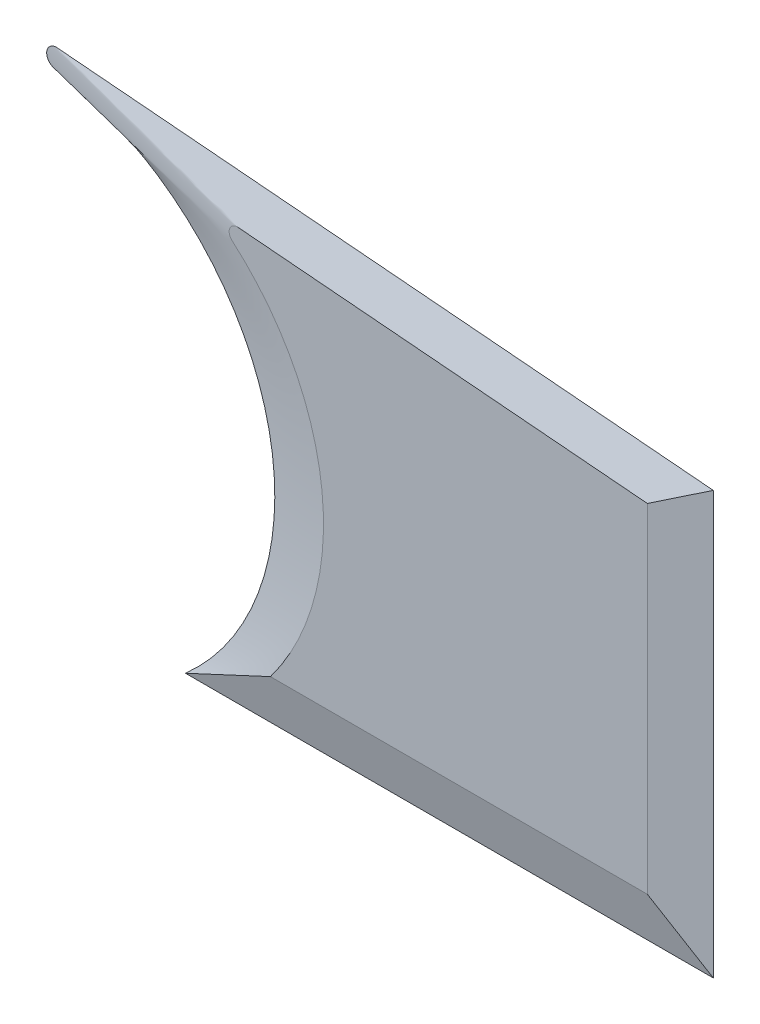
ISO-10303-21;
HEADER;
FILE_DESCRIPTION(('STEP AP214'),'2;1');
FILE_NAME('part.step','',(''),(''),'','','');
FILE_SCHEMA(('AUTOMOTIVE_DESIGN { 1 0 10303 214 1 1 1 1 }'));
ENDSEC;
DATA;
#1=APPLICATION_CONTEXT('core data for automotive mechanical design processes');
#2=APPLICATION_PROTOCOL_DEFINITION('international standard','automotive_design',2000,#1);
#3=PRODUCT_CONTEXT('',#1,'mechanical');
#4=PRODUCT('Part','Part','',(#3));
#5=PRODUCT_RELATED_PRODUCT_CATEGORY('part','',(#4));
#6=PRODUCT_DEFINITION_FORMATION('','',#4);
#7=PRODUCT_DEFINITION_CONTEXT('part definition',#1,'design');
#8=PRODUCT_DEFINITION('design','',#6,#7);
#9=PRODUCT_DEFINITION_SHAPE('','',#8);
#10=(LENGTH_UNIT() NAMED_UNIT(*) SI_UNIT(.MILLI.,.METRE.));
#11=(NAMED_UNIT(*) PLANE_ANGLE_UNIT() SI_UNIT($,.RADIAN.));
#12=(NAMED_UNIT(*) SI_UNIT($,.STERADIAN.) SOLID_ANGLE_UNIT());
#13=UNCERTAINTY_MEASURE_WITH_UNIT(LENGTH_MEASURE(1.E-05),#10,'distance_accuracy_value','');
#14=(GEOMETRIC_REPRESENTATION_CONTEXT(3) GLOBAL_UNCERTAINTY_ASSIGNED_CONTEXT((#13)) GLOBAL_UNIT_ASSIGNED_CONTEXT((#10,
#11,#12)) REPRESENTATION_CONTEXT('',''));
#15=CARTESIAN_POINT('',(0.,0.,0.));
#16=DIRECTION('',(0.,0.,1.));
#17=DIRECTION('',(1.,0.,0.));
#18=AXIS2_PLACEMENT_3D('',#15,#16,#17);
#19=CARTESIAN_POINT('',(-27.1135764349336,50.8740148749236,3.175));
#20=DIRECTION('',(0.,0.,1.));
#21=DIRECTION('',(1.,0.,0.));
#22=AXIS2_PLACEMENT_3D('',#19,#20,#21);
#23=PLANE('',#22);
#24=CARTESIAN_POINT('',(-27.1135764349336,50.8740148749236,3.175));
#25=DIRECTION('',(0.,0.,-1.));
#26=DIRECTION('',(1.,0.,0.));
#27=AXIS2_PLACEMENT_3D('',#24,#25,#26);
#28=CIRCLE('',#27,63.5);
#29=CARTESIAN_POINT('',(14.3699078236862,98.9507299640895,3.175));
#30=VERTEX_POINT('',#29);
#31=CARTESIAN_POINT('',(23.6308280677218,12.7,3.175));
#32=VERTEX_POINT('',#31);
#33=EDGE_CURVE('E262',#30,#32,#28,.T.);
#34=ORIENTED_EDGE('',*,*,#33,.T.);
#35=DIRECTION('',(1.,0.,0.));
#36=VECTOR('',#35,1.);
#37=CARTESIAN_POINT('',(23.6308280677218,12.7,3.175));
#38=LINE('',#37,#36);
#39=CARTESIAN_POINT('',(114.3,12.7,3.175));
#40=VERTEX_POINT('',#39);
#41=EDGE_CURVE('E12',#32,#40,#38,.T.);
#42=ORIENTED_EDGE('',*,*,#41,.T.);
#43=DIRECTION('',(0.,1.,0.));
#44=VECTOR('',#43,1.);
#45=CARTESIAN_POINT('',(114.3,12.7,3.175));
#46=LINE('',#45,#44);
#47=CARTESIAN_POINT('',(114.3,94.1158794923992,3.175));
#48=VERTEX_POINT('',#47);
#49=EDGE_CURVE('E121',#40,#48,#46,.T.);
#50=ORIENTED_EDGE('',*,*,#49,.T.);
#51=DIRECTION('',(-0.996475615581712,0.0838829395708538,0.));
#52=VECTOR('',#51,1.);
#53=CARTESIAN_POINT('',(114.3,94.1158794923992,3.175));
#54=LINE('',#53,#52);
#55=CARTESIAN_POINT('',(15.8222911685086,102.405695690426,3.175));
#56=VERTEX_POINT('',#55);
#57=EDGE_CURVE('E135',#48,#56,#54,.T.);
#58=ORIENTED_EDGE('',*,*,#57,.T.);
#59=CARTESIAN_POINT('',(15.6570228862959,100.442414311679,3.175));
#60=DIRECTION('',(0.,0.,1.));
#61=DIRECTION('',(-1.,0.,0.));
#62=AXIS2_PLACEMENT_3D('',#59,#60,#61);
#63=CIRCLE('',#62,1.9702252097769);
#64=EDGE_CURVE('E129',#56,#30,#63,.T.);
#65=ORIENTED_EDGE('',*,*,#64,.T.);
#66=EDGE_LOOP('',(#34,#42,#50,#58,#65));
#67=FACE_BOUND('',#66,.T.);
#68=ADVANCED_FACE('F110',(#67),#23,.T.);
#69=CARTESIAN_POINT('',(-42.0001751641452,47.6259938078054,0.));
#70=DIRECTION('',(0.,0.,1.));
#71=DIRECTION('',(1.,0.,0.));
#72=AXIS2_PLACEMENT_3D('',#69,#70,#71);
#73=PLANE('',#72);
#74=CARTESIAN_POINT('',(-42.0001751641452,47.6259938078054,0.));
#75=DIRECTION('',(0.,0.,-1.));
#76=DIRECTION('',(1.,0.,0.));
#77=AXIS2_PLACEMENT_3D('',#74,#75,#76);
#78=CIRCLE('',#77,63.5);
#79=CARTESIAN_POINT('',(-31.4323677402285,110.240460556721,0.));
#80=VERTEX_POINT('',#79);
#81=CARTESIAN_POINT('',(0.,0.,0.));
#82=VERTEX_POINT('',#81);
#83=EDGE_CURVE('E167',#80,#82,#78,.T.);
#84=ORIENTED_EDGE('',*,*,#83,.F.);
#85=CARTESIAN_POINT('',(-31.0422845014005,112.551711415982,0.));
#86=DIRECTION('',(0.,0.,1.));
#87=DIRECTION('',(1.,0.,0.));
#88=AXIS2_PLACEMENT_3D('',#85,#86,#87);
#89=CIRCLE('',#88,2.3439380255567);
#90=CARTESIAN_POINT('',(-30.8456680906218,114.887388502966,0.));
#91=VERTEX_POINT('',#90);
#92=EDGE_CURVE('E185',#91,#80,#89,.T.);
#93=ORIENTED_EDGE('',*,*,#92,.F.);
#94=DIRECTION('',(-0.996475615581712,0.0838829395708536,0.));
#95=VECTOR('',#94,1.);
#96=CARTESIAN_POINT('',(127.,101.6,0.));
#97=LINE('',#96,#95);
#98=CARTESIAN_POINT('',(127.,101.6,0.));
#99=VERTEX_POINT('',#98);
#100=EDGE_CURVE('E311',#99,#91,#97,.T.);
#101=ORIENTED_EDGE('',*,*,#100,.F.);
#102=DIRECTION('',(0.,1.,0.));
#103=VECTOR('',#102,1.);
#104=CARTESIAN_POINT('',(127.,0.,0.));
#105=LINE('',#104,#103);
#106=CARTESIAN_POINT('',(127.,0.,0.));
#107=VERTEX_POINT('',#106);
#108=EDGE_CURVE('E170',#107,#99,#105,.T.);
#109=ORIENTED_EDGE('',*,*,#108,.F.);
#110=DIRECTION('',(1.,0.,0.));
#111=VECTOR('',#110,1.);
#112=CARTESIAN_POINT('',(0.,0.,0.));
#113=LINE('',#112,#111);
#114=EDGE_CURVE('E162',#82,#107,#113,.T.);
#115=ORIENTED_EDGE('',*,*,#114,.F.);
#116=EDGE_LOOP('',(#84,#93,#101,#109,#115));
#117=FACE_BOUND('',#116,.T.);
#118=ADVANCED_FACE('F165',(#117),#73,.F.);
#119=CARTESIAN_POINT('',(0.,0.,0.));
#120=DIRECTION('',(0.,-0.242535625036333,0.970142500145332));
#121=DIRECTION('',(1.,0.,0.));
#122=AXIS2_PLACEMENT_3D('',#119,#120,#121);
#123=PLANE('',#122);
#124=ORIENTED_EDGE('',*,*,#114,.T.);
#125=DIRECTION('',(-0.696310623822792,0.696310623822791,0.174077655955698));
#126=VECTOR('',#125,1.);
#127=CARTESIAN_POINT('',(120.65,6.35,1.5875));
#128=LINE('',#127,#126);
#129=EDGE_CURVE('E194',#107,#40,#128,.T.);
#130=ORIENTED_EDGE('',*,*,#129,.T.);
#131=ORIENTED_EDGE('',*,*,#41,.F.);
#132=DIRECTION('',(-0.874744015721847,-0.470116788452369,-0.117529197113092));
#133=VECTOR('',#132,1.);
#134=CARTESIAN_POINT('',(11.8154140338609,6.35,1.5875));
#135=LINE('',#134,#133);
#136=EDGE_CURVE('E177',#32,#82,#135,.T.);
#137=ORIENTED_EDGE('',*,*,#136,.T.);
#138=EDGE_LOOP('',(#124,#130,#131,#137));
#139=FACE_BOUND('',#138,.T.);
#140=ADVANCED_FACE('F191',(#139),#123,.T.);
#141=CARTESIAN_POINT('',(127.,0.,0.));
#142=DIRECTION('',(0.242535625036333,0.,0.970142500145332));
#143=DIRECTION('',(0.,1.,0.));
#144=AXIS2_PLACEMENT_3D('',#141,#142,#143);
#145=PLANE('',#144);
#146=ORIENTED_EDGE('',*,*,#108,.T.);
#147=DIRECTION('',(-0.842218983141479,-0.496320343592111,0.21055474578537));
#148=VECTOR('',#147,1.);
#149=CARTESIAN_POINT('',(120.65,97.8579397461996,1.5875));
#150=LINE('',#149,#148);
#151=EDGE_CURVE('E197',#99,#48,#150,.T.);
#152=ORIENTED_EDGE('',*,*,#151,.T.);
#153=ORIENTED_EDGE('',*,*,#49,.F.);
#154=ORIENTED_EDGE('',*,*,#129,.F.);
#155=EDGE_LOOP('',(#146,#152,#153,#154));
#156=FACE_BOUND('',#155,.T.);
#157=ADVANCED_FACE('F217',(#156),#145,.T.);
#158=CARTESIAN_POINT('',(127.,101.6,0.));
#159=CARTESIAN_POINT('',(114.3,94.1158794923992,3.175));
#160=CARTESIAN_POINT('',(114.051649116652,102.689987268837,0.));
#161=CARTESIAN_POINT('',(105.951484684091,94.8186543468967,3.175));
#162=CARTESIAN_POINT('',(87.9410835460794,104.887964780447,0.));
#163=CARTESIAN_POINT('',(89.4110876346573,96.2110187003041,3.175));
#164=CARTESIAN_POINT('',(48.3711853806058,108.218943807668,0.));
#165=CARTESIAN_POINT('',(64.8680677542763,98.2770408099473,3.175));
#166=CARTESIAN_POINT('',(8.66202439572194,111.561645926234,0.));
#167=CARTESIAN_POINT('',(40.4117537930164,100.335764048188,3.175));
#168=CARTESIAN_POINT('',(-17.7207962192004,113.78254176427,0.));
#169=CARTESIAN_POINT('',(24.0487700657803,101.713193815387,3.175));
#170=CARTESIAN_POINT('',(-31.1577755917525,114.913661594096,0.));
#171=CARTESIAN_POINT('',(15.6266667231408,102.422163282079,3.175));
#172=CARTESIAN_POINT('',(-31.7826262733344,114.839181856667,0.));
#173=CARTESIAN_POINT('',(15.2243892679779,102.395034163977,3.175));
#174=CARTESIAN_POINT('',(-32.5885598193302,114.389795084459,0.));
#175=CARTESIAN_POINT('',(14.6489637503913,102.174491921176,3.175));
#176=CARTESIAN_POINT('',(-33.1593963567512,113.683439408603,0.));
#177=CARTESIAN_POINT('',(14.1626052564013,101.774445451299,3.175));
#178=CARTESIAN_POINT('',(-33.4266311022377,112.824394855964,0.));
#179=CARTESIAN_POINT('',(13.8166718373353,101.241010465291,3.175));
#180=CARTESIAN_POINT('',(-33.3602937205731,111.930472174799,0.));
#181=CARTESIAN_POINT('',(13.6625215445206,100.620302674099,3.175));
#182=CARTESIAN_POINT('',(-32.9699983402129,111.121502066574,0.));
#183=CARTESIAN_POINT('',(13.7047416717755,99.9833031239969,3.175));
#184=CARTESIAN_POINT('',(-32.3039057569374,110.508156288033,0.));
#185=CARTESIAN_POINT('',(13.9479195129184,99.4009928612591,3.175));
#186=CARTESIAN_POINT('',(-31.7316332591501,110.290969337467,0.));
#187=CARTESIAN_POINT('',(14.2161897846502,99.0833671428317,3.175));
#188=CARTESIAN_POINT('',(-25.5626110222964,109.249787604591,0.));
#189=CARTESIAN_POINT('',(17.3849143391229,96.3492008227831,3.175));
#190=CARTESIAN_POINT('',(-14.12700787829,105.612655143334,0.));
#191=CARTESIAN_POINT('',(22.9365590224414,90.5661879828474,3.175));
#192=CARTESIAN_POINT('',(0.812481000113713,95.6470229208942,0.));
#193=CARTESIAN_POINT('',(29.5038043315161,80.4562057731597,3.175));
#194=CARTESIAN_POINT('',(12.4099511249624,81.9556109148874,0.));
#195=CARTESIAN_POINT('',(34.056658493627,69.2818465819784,3.175));
#196=CARTESIAN_POINT('',(19.7802655841202,65.5823164265238,0.));
#197=CARTESIAN_POINT('',(36.4246868362393,57.4599053439086,3.175));
#198=CARTESIAN_POINT('',(22.3419595640734,47.769981492844,0.));
#199=CARTESIAN_POINT('',(36.5305173343026,45.4332385070915,3.175));
#200=CARTESIAN_POINT('',(19.8535562715358,29.8785930687666,0.));
#201=CARTESIAN_POINT('',(34.3921770534188,33.6478231612116,3.17499999999999));
#202=CARTESIAN_POINT('',(12.4418030844914,13.2987009280577,0.));
#203=CARTESIAN_POINT('',(30.120481655145,22.5302883590042,3.175));
#204=CARTESIAN_POINT('',(4.54559424223058,4.00864610131295,0.));
#205=CARTESIAN_POINT('',(25.9799699110557,15.8226949620789,3.175));
#206=CARTESIAN_POINT('',(0.,0.,0.));
#207=CARTESIAN_POINT('',(23.6308280677218,12.7,3.175));
#208=B_SPLINE_SURFACE_WITH_KNOTS('',3,1,((#158,#159),(#160,#161),(#162,#163),(#164,#165),(#166,
#167),(#168,#169),(#170,#171),(#172,#173),(#174,#175),(#176,#177),(#178,#179),(#180,#181),(#182,
#183),(#184,#185),(#186,#187),(#188,#189),(#190,#191),(#192,#193),(#194,#195),(#196,#197),(#198,
#199),(#200,#201),(#202,#203),(#204,#205),(#206,#207)),.UNSPECIFIED.,.F.,.F.,.F.,(4,1,1,1,2,1,1,
1,1,1,1,1,2,1,1,1,1,1,1,1,4),(2,2),(0.,0.126237773261326,0.252475546522652,0.378713319783978,
0.504951093045304,0.507953008549279,0.510954924053254,0.513956839557229,0.516958755061203,
0.519960670565178,0.522962586069153,0.525964501573127,0.528966417077102,0.587845614942464,
0.646724812807827,0.705604010673189,0.764483208538551,0.823362406403913,0.882241604269276,
0.941120802134638,1.),(0.,1.),.UNSPECIFIED.);
#209=ORIENTED_EDGE('',*,*,#100,.T.);
#210=ORIENTED_EDGE('',*,*,#92,.T.);
#211=ORIENTED_EDGE('',*,*,#83,.T.);
#212=ORIENTED_EDGE('',*,*,#136,.F.);
#213=ORIENTED_EDGE('',*,*,#33,.F.);
#214=ORIENTED_EDGE('',*,*,#64,.F.);
#215=ORIENTED_EDGE('',*,*,#57,.F.);
#216=ORIENTED_EDGE('',*,*,#151,.F.);
#217=EDGE_LOOP('',(#209,#210,#211,#212,#213,#214,#215,#216));
#218=FACE_BOUND('',#217,.T.);
#219=ADVANCED_FACE('F183',(#218),#208,.T.);
#220=CLOSED_SHELL('',(#68,#118,#140,#157,#219));
#221=MANIFOLD_SOLID_BREP('B2',#220);
#222=ADVANCED_BREP_SHAPE_REPRESENTATION('',(#18,#221),#14);
#223=SHAPE_DEFINITION_REPRESENTATION(#9,#222);
ENDSEC;
END-ISO-10303-21;
